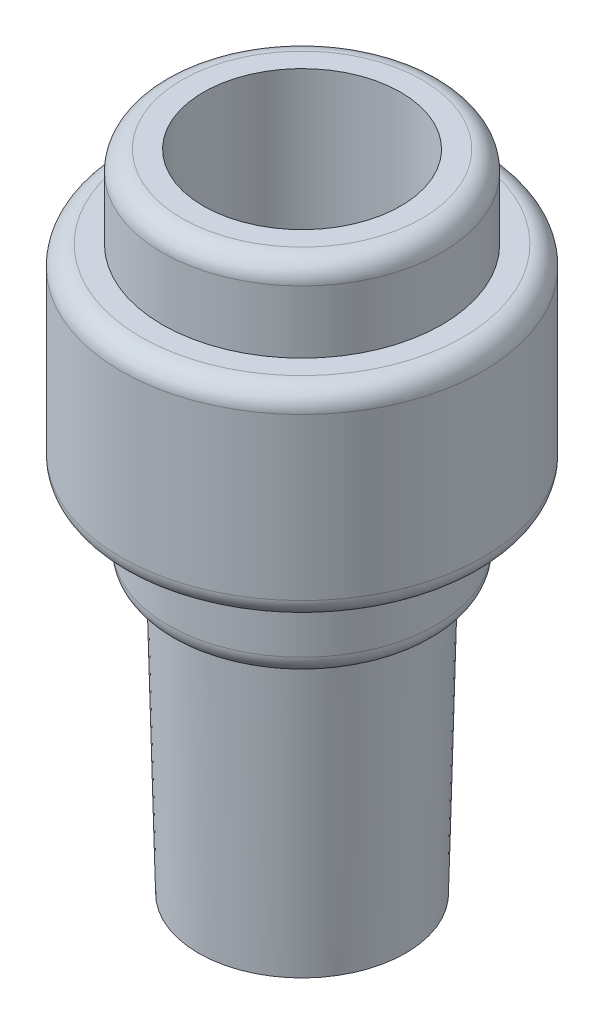
ISO-10303-21;
HEADER;
FILE_DESCRIPTION(('STEP AP214'),'2;1');
FILE_NAME('part.step','',(''),(''),'','','');
FILE_SCHEMA(('AUTOMOTIVE_DESIGN { 1 0 10303 214 1 1 1 1 }'));
ENDSEC;
DATA;
#1=APPLICATION_CONTEXT('core data for automotive mechanical design processes');
#2=APPLICATION_PROTOCOL_DEFINITION('international standard','automotive_design',2000,#1);
#3=PRODUCT_CONTEXT('',#1,'mechanical');
#4=PRODUCT('Part','Part','',(#3));
#5=PRODUCT_RELATED_PRODUCT_CATEGORY('part','',(#4));
#6=PRODUCT_DEFINITION_FORMATION('','',#4);
#7=PRODUCT_DEFINITION_CONTEXT('part definition',#1,'design');
#8=PRODUCT_DEFINITION('design','',#6,#7);
#9=PRODUCT_DEFINITION_SHAPE('','',#8);
#10=(LENGTH_UNIT() NAMED_UNIT(*) SI_UNIT(.MILLI.,.METRE.));
#11=(NAMED_UNIT(*) PLANE_ANGLE_UNIT() SI_UNIT($,.RADIAN.));
#12=(NAMED_UNIT(*) SI_UNIT($,.STERADIAN.) SOLID_ANGLE_UNIT());
#13=UNCERTAINTY_MEASURE_WITH_UNIT(LENGTH_MEASURE(1.E-05),#10,'distance_accuracy_value','');
#14=(GEOMETRIC_REPRESENTATION_CONTEXT(3) GLOBAL_UNCERTAINTY_ASSIGNED_CONTEXT((#13)) GLOBAL_UNIT_ASSIGNED_CONTEXT((#10,
#11,#12)) REPRESENTATION_CONTEXT('',''));
#15=CARTESIAN_POINT('',(0.,0.,0.));
#16=DIRECTION('',(0.,0.,1.));
#17=DIRECTION('',(1.,0.,0.));
#18=AXIS2_PLACEMENT_3D('',#15,#16,#17);
#19=CARTESIAN_POINT('',(0.,17.1,0.));
#20=DIRECTION('',(0.,1.,0.));
#21=DIRECTION('',(0.,0.,1.));
#22=AXIS2_PLACEMENT_3D('',#19,#20,#21);
#23=PLANE('',#22);
#24=CARTESIAN_POINT('',(0.,17.1,0.));
#25=DIRECTION('',(0.,1.,0.));
#26=DIRECTION('',(0.,0.,1.));
#27=AXIS2_PLACEMENT_3D('',#24,#25,#26);
#28=CIRCLE('',#27,4.9);
#29=CARTESIAN_POINT('',(0.,17.1,4.9));
#30=VERTEX_POINT('',#29);
#31=EDGE_CURVE('E42',#30,#30,#28,.T.);
#32=ORIENTED_EDGE('',*,*,#31,.T.);
#33=EDGE_LOOP('',(#32));
#34=FACE_BOUND('',#33,.T.);
#35=CARTESIAN_POINT('',(0.,17.1,0.));
#36=DIRECTION('',(0.,1.,0.));
#37=DIRECTION('',(0.,0.,1.));
#38=AXIS2_PLACEMENT_3D('',#35,#36,#37);
#39=CIRCLE('',#38,4.25);
#40=CARTESIAN_POINT('',(0.,17.1,4.25));
#41=VERTEX_POINT('',#40);
#42=EDGE_CURVE('E72',#41,#41,#39,.T.);
#43=ORIENTED_EDGE('',*,*,#42,.F.);
#44=EDGE_LOOP('',(#43));
#45=FACE_BOUND('',#44,.T.);
#46=ADVANCED_FACE('F31',(#34,#45),#23,.T.);
#47=CARTESIAN_POINT('',(0.,0.,0.));
#48=DIRECTION('',(0.,1.,0.));
#49=DIRECTION('',(0.,0.,1.));
#50=AXIS2_PLACEMENT_3D('',#47,#48,#49);
#51=CONICAL_SURFACE('',#50,3.15,0.0235619449019235);
#52=CARTESIAN_POINT('',(0.,8.5,0.));
#53=DIRECTION('',(0.,1.,0.));
#54=DIRECTION('',(0.,0.,1.));
#55=AXIS2_PLACEMENT_3D('',#52,#53,#54);
#56=CIRCLE('',#55,3.35031360208855);
#57=CARTESIAN_POINT('',(0.,8.5,3.35031360208855));
#58=VERTEX_POINT('',#57);
#59=EDGE_CURVE('E63',#58,#58,#56,.T.);
#60=ORIENTED_EDGE('',*,*,#59,.F.);
#61=EDGE_LOOP('',(#60));
#62=FACE_BOUND('',#61,.T.);
#63=CARTESIAN_POINT('',(0.,0.,0.));
#64=DIRECTION('',(0.,1.,0.));
#65=DIRECTION('',(0.,0.,1.));
#66=AXIS2_PLACEMENT_3D('',#63,#64,#65);
#67=CIRCLE('',#66,3.15);
#68=CARTESIAN_POINT('',(0.,0.,3.15));
#69=VERTEX_POINT('',#68);
#70=EDGE_CURVE('E66',#69,#69,#67,.T.);
#71=ORIENTED_EDGE('',*,*,#70,.T.);
#72=EDGE_LOOP('',(#71));
#73=FACE_BOUND('',#72,.T.);
#74=ADVANCED_FACE('F95',(#62,#73),#51,.T.);
#75=CARTESIAN_POINT('',(0.,0.,0.));
#76=DIRECTION('',(0.,1.,0.));
#77=DIRECTION('',(0.,0.,1.));
#78=AXIS2_PLACEMENT_3D('',#75,#76,#77);
#79=PLANE('',#78);
#80=CARTESIAN_POINT('',(0.,0.,0.));
#81=DIRECTION('',(0.,-1.,0.));
#82=DIRECTION('',(0.,0.,-1.));
#83=AXIS2_PLACEMENT_3D('',#80,#81,#82);
#84=CIRCLE('',#83,1.5);
#85=CARTESIAN_POINT('',(0.,0.,-1.5));
#86=VERTEX_POINT('',#85);
#87=EDGE_CURVE('E84',#86,#86,#84,.T.);
#88=ORIENTED_EDGE('',*,*,#87,.F.);
#89=EDGE_LOOP('',(#88));
#90=FACE_BOUND('',#89,.T.);
#91=ORIENTED_EDGE('',*,*,#70,.F.);
#92=EDGE_LOOP('',(#91));
#93=FACE_BOUND('',#92,.T.);
#94=ADVANCED_FACE('F91',(#90,#93),#79,.F.);
#95=CARTESIAN_POINT('',(0.,8.5,0.));
#96=DIRECTION('',(0.,1.,0.));
#97=DIRECTION('',(0.,0.,1.));
#98=AXIS2_PLACEMENT_3D('',#95,#96,#97);
#99=PLANE('',#98);
#100=CARTESIAN_POINT('',(0.,8.5,0.));
#101=DIRECTION('',(0.,1.,0.));
#102=DIRECTION('',(0.,0.,1.));
#103=AXIS2_PLACEMENT_3D('',#100,#101,#102);
#104=CIRCLE('',#103,3.475);
#105=CARTESIAN_POINT('',(0.,8.5,3.475));
#106=VERTEX_POINT('',#105);
#107=EDGE_CURVE('E57',#106,#106,#104,.F.);
#108=ORIENTED_EDGE('',*,*,#107,.T.);
#109=EDGE_LOOP('',(#108));
#110=FACE_BOUND('',#109,.T.);
#111=ORIENTED_EDGE('',*,*,#59,.T.);
#112=EDGE_LOOP('',(#111));
#113=FACE_BOUND('',#112,.T.);
#114=ADVANCED_FACE('F94',(#110,#113),#99,.F.);
#115=CARTESIAN_POINT('',(0.,11.,0.));
#116=DIRECTION('',(0.,-1.,0.));
#117=DIRECTION('',(0.,0.,-1.));
#118=AXIS2_PLACEMENT_3D('',#115,#116,#117);
#119=CYLINDRICAL_SURFACE('',#118,4.075);
#120=CARTESIAN_POINT('',(0.,9.1,0.));
#121=DIRECTION('',(0.,1.,0.));
#122=DIRECTION('',(0.,0.,1.));
#123=AXIS2_PLACEMENT_3D('',#120,#121,#122);
#124=CIRCLE('',#123,4.075);
#125=CARTESIAN_POINT('',(0.,9.1,4.075));
#126=VERTEX_POINT('',#125);
#127=EDGE_CURVE('E60',#126,#126,#124,.T.);
#128=ORIENTED_EDGE('',*,*,#127,.T.);
#129=EDGE_LOOP('',(#128));
#130=FACE_BOUND('',#129,.T.);
#131=CARTESIAN_POINT('',(0.,11.,0.));
#132=DIRECTION('',(0.,1.,0.));
#133=DIRECTION('',(0.,0.,1.));
#134=AXIS2_PLACEMENT_3D('',#131,#132,#133);
#135=CIRCLE('',#134,4.075);
#136=CARTESIAN_POINT('',(0.,11.,4.075));
#137=VERTEX_POINT('',#136);
#138=EDGE_CURVE('E69',#137,#137,#135,.T.);
#139=ORIENTED_EDGE('',*,*,#138,.F.);
#140=EDGE_LOOP('',(#139));
#141=FACE_BOUND('',#140,.T.);
#142=ADVANCED_FACE('F147',(#130,#141),#119,.T.);
#143=CARTESIAN_POINT('',(0.,11.,0.));
#144=DIRECTION('',(0.,1.,0.));
#145=DIRECTION('',(0.,0.,1.));
#146=AXIS2_PLACEMENT_3D('',#143,#144,#145);
#147=PLANE('',#146);
#148=CARTESIAN_POINT('',(0.,11.,0.));
#149=DIRECTION('',(0.,1.,0.));
#150=DIRECTION('',(0.,0.,1.));
#151=AXIS2_PLACEMENT_3D('',#148,#149,#150);
#152=CIRCLE('',#151,4.9);
#153=CARTESIAN_POINT('',(0.,11.,4.9));
#154=VERTEX_POINT('',#153);
#155=EDGE_CURVE('E46',#154,#154,#152,.F.);
#156=ORIENTED_EDGE('',*,*,#155,.T.);
#157=EDGE_LOOP('',(#156));
#158=FACE_BOUND('',#157,.T.);
#159=ORIENTED_EDGE('',*,*,#138,.T.);
#160=EDGE_LOOP('',(#159));
#161=FACE_BOUND('',#160,.T.);
#162=ADVANCED_FACE('F141',(#158,#161),#147,.F.);
#163=CARTESIAN_POINT('',(0.,17.1,0.));
#164=DIRECTION('',(0.,-1.,0.));
#165=DIRECTION('',(0.,0.,-1.));
#166=AXIS2_PLACEMENT_3D('',#163,#164,#165);
#167=CYLINDRICAL_SURFACE('',#166,5.5);
#168=CARTESIAN_POINT('',(0.,11.6,0.));
#169=DIRECTION('',(0.,1.,0.));
#170=DIRECTION('',(0.,0.,1.));
#171=AXIS2_PLACEMENT_3D('',#168,#169,#170);
#172=CIRCLE('',#171,5.5);
#173=CARTESIAN_POINT('',(0.,11.6,5.5));
#174=VERTEX_POINT('',#173);
#175=EDGE_CURVE('E51',#174,#174,#172,.T.);
#176=ORIENTED_EDGE('',*,*,#175,.T.);
#177=EDGE_LOOP('',(#176));
#178=FACE_BOUND('',#177,.T.);
#179=CARTESIAN_POINT('',(0.,16.5,0.));
#180=DIRECTION('',(0.,1.,0.));
#181=DIRECTION('',(0.,0.,1.));
#182=AXIS2_PLACEMENT_3D('',#179,#180,#181);
#183=CIRCLE('',#182,5.5);
#184=CARTESIAN_POINT('',(0.,16.5,5.5));
#185=VERTEX_POINT('',#184);
#186=EDGE_CURVE('E54',#185,#185,#183,.F.);
#187=ORIENTED_EDGE('',*,*,#186,.T.);
#188=EDGE_LOOP('',(#187));
#189=FACE_BOUND('',#188,.T.);
#190=ADVANCED_FACE('F133',(#178,#189),#167,.T.);
#191=CARTESIAN_POINT('',(0.,19.6,0.));
#192=DIRECTION('',(0.,-1.,0.));
#193=DIRECTION('',(0.,0.,-1.));
#194=AXIS2_PLACEMENT_3D('',#191,#192,#193);
#195=CYLINDRICAL_SURFACE('',#194,4.25);
#196=CARTESIAN_POINT('',(0.,19.,0.));
#197=DIRECTION('',(0.,1.,0.));
#198=DIRECTION('',(0.,0.,1.));
#199=AXIS2_PLACEMENT_3D('',#196,#197,#198);
#200=CIRCLE('',#199,4.25);
#201=CARTESIAN_POINT('',(0.,19.,4.25));
#202=VERTEX_POINT('',#201);
#203=EDGE_CURVE('E10',#202,#202,#200,.F.);
#204=ORIENTED_EDGE('',*,*,#203,.T.);
#205=EDGE_LOOP('',(#204));
#206=FACE_BOUND('',#205,.T.);
#207=ORIENTED_EDGE('',*,*,#42,.T.);
#208=EDGE_LOOP('',(#207));
#209=FACE_BOUND('',#208,.T.);
#210=ADVANCED_FACE('F130',(#206,#209),#195,.T.);
#211=CARTESIAN_POINT('',(0.,19.6,0.));
#212=DIRECTION('',(0.,1.,0.));
#213=DIRECTION('',(0.,0.,1.));
#214=AXIS2_PLACEMENT_3D('',#211,#212,#213);
#215=PLANE('',#214);
#216=CARTESIAN_POINT('',(0.,19.6,0.));
#217=DIRECTION('',(0.,1.,0.));
#218=DIRECTION('',(0.,0.,1.));
#219=AXIS2_PLACEMENT_3D('',#216,#217,#218);
#220=CIRCLE('',#219,3.65);
#221=CARTESIAN_POINT('',(0.,19.6,3.65));
#222=VERTEX_POINT('',#221);
#223=EDGE_CURVE('E38',#222,#222,#220,.T.);
#224=ORIENTED_EDGE('',*,*,#223,.T.);
#225=EDGE_LOOP('',(#224));
#226=FACE_BOUND('',#225,.T.);
#227=CARTESIAN_POINT('',(0.,19.6,0.));
#228=DIRECTION('',(0.,1.,0.));
#229=DIRECTION('',(0.,0.,1.));
#230=AXIS2_PLACEMENT_3D('',#227,#228,#229);
#231=CIRCLE('',#230,3.);
#232=CARTESIAN_POINT('',(0.,19.6,3.));
#233=VERTEX_POINT('',#232);
#234=EDGE_CURVE('E76',#233,#233,#231,.T.);
#235=ORIENTED_EDGE('',*,*,#234,.F.);
#236=EDGE_LOOP('',(#235));
#237=FACE_BOUND('',#236,.T.);
#238=ADVANCED_FACE('F132',(#226,#237),#215,.T.);
#239=CARTESIAN_POINT('',(0.,13.1,0.));
#240=DIRECTION('',(0.,1.,0.));
#241=DIRECTION('',(0.,0.,1.));
#242=AXIS2_PLACEMENT_3D('',#239,#240,#241);
#243=CYLINDRICAL_SURFACE('',#242,3.);
#244=CARTESIAN_POINT('',(0.,13.1,0.));
#245=DIRECTION('',(0.,1.,0.));
#246=DIRECTION('',(0.,0.,1.));
#247=AXIS2_PLACEMENT_3D('',#244,#245,#246);
#248=CIRCLE('',#247,3.);
#249=CARTESIAN_POINT('',(0.,13.1,3.));
#250=VERTEX_POINT('',#249);
#251=EDGE_CURVE('E75',#250,#250,#248,.T.);
#252=ORIENTED_EDGE('',*,*,#251,.F.);
#253=EDGE_LOOP('',(#252));
#254=FACE_BOUND('',#253,.T.);
#255=ORIENTED_EDGE('',*,*,#234,.T.);
#256=EDGE_LOOP('',(#255));
#257=FACE_BOUND('',#256,.T.);
#258=ADVANCED_FACE('F139',(#254,#257),#243,.F.);
#259=CARTESIAN_POINT('',(0.,13.1,0.));
#260=DIRECTION('',(0.,1.,0.));
#261=DIRECTION('',(0.,0.,1.));
#262=AXIS2_PLACEMENT_3D('',#259,#260,#261);
#263=PLANE('',#262);
#264=CARTESIAN_POINT('',(0.,13.1,0.));
#265=DIRECTION('',(0.,1.,0.));
#266=DIRECTION('',(0.,0.,1.));
#267=AXIS2_PLACEMENT_3D('',#264,#265,#266);
#268=CIRCLE('',#267,1.5);
#269=CARTESIAN_POINT('',(0.,13.1,1.5));
#270=VERTEX_POINT('',#269);
#271=EDGE_CURVE('E79',#270,#270,#268,.F.);
#272=ORIENTED_EDGE('',*,*,#271,.T.);
#273=EDGE_LOOP('',(#272));
#274=FACE_BOUND('',#273,.T.);
#275=ORIENTED_EDGE('',*,*,#251,.T.);
#276=EDGE_LOOP('',(#275));
#277=FACE_BOUND('',#276,.T.);
#278=ADVANCED_FACE('F215',(#274,#277),#263,.T.);
#279=CARTESIAN_POINT('',(0.,17.3426406871193,0.));
#280=DIRECTION('',(0.,-1.,0.));
#281=DIRECTION('',(0.,0.,-1.));
#282=AXIS2_PLACEMENT_3D('',#279,#280,#281);
#283=CYLINDRICAL_SURFACE('',#282,1.5);
#284=ORIENTED_EDGE('',*,*,#87,.T.);
#285=EDGE_LOOP('',(#284));
#286=FACE_BOUND('',#285,.T.);
#287=ORIENTED_EDGE('',*,*,#271,.F.);
#288=EDGE_LOOP('',(#287));
#289=FACE_BOUND('',#288,.T.);
#290=ADVANCED_FACE('F88',(#286,#289),#283,.F.);
#291=CARTESIAN_POINT('',(0.,9.1,0.));
#292=DIRECTION('',(0.,1.,0.));
#293=DIRECTION('',(0.,0.,1.));
#294=AXIS2_PLACEMENT_3D('',#291,#292,#293);
#295=TOROIDAL_SURFACE('',#294,3.475,0.6);
#296=ORIENTED_EDGE('',*,*,#107,.F.);
#297=EDGE_LOOP('',(#296));
#298=FACE_BOUND('',#297,.T.);
#299=ORIENTED_EDGE('',*,*,#127,.F.);
#300=EDGE_LOOP('',(#299));
#301=FACE_BOUND('',#300,.T.);
#302=ADVANCED_FACE('F110',(#298,#301),#295,.T.);
#303=CARTESIAN_POINT('',(0.,11.6,0.));
#304=DIRECTION('',(0.,1.,0.));
#305=DIRECTION('',(0.,0.,1.));
#306=AXIS2_PLACEMENT_3D('',#303,#304,#305);
#307=TOROIDAL_SURFACE('',#306,4.9,0.6);
#308=ORIENTED_EDGE('',*,*,#155,.F.);
#309=EDGE_LOOP('',(#308));
#310=FACE_BOUND('',#309,.T.);
#311=ORIENTED_EDGE('',*,*,#175,.F.);
#312=EDGE_LOOP('',(#311));
#313=FACE_BOUND('',#312,.T.);
#314=ADVANCED_FACE('F113',(#310,#313),#307,.T.);
#315=CARTESIAN_POINT('',(0.,16.5,0.));
#316=DIRECTION('',(0.,1.,0.));
#317=DIRECTION('',(0.,0.,1.));
#318=AXIS2_PLACEMENT_3D('',#315,#316,#317);
#319=TOROIDAL_SURFACE('',#318,4.9,0.6);
#320=ORIENTED_EDGE('',*,*,#186,.F.);
#321=EDGE_LOOP('',(#320));
#322=FACE_BOUND('',#321,.T.);
#323=ORIENTED_EDGE('',*,*,#31,.F.);
#324=EDGE_LOOP('',(#323));
#325=FACE_BOUND('',#324,.T.);
#326=ADVANCED_FACE('F116',(#322,#325),#319,.T.);
#327=CARTESIAN_POINT('',(0.,19.,0.));
#328=DIRECTION('',(0.,1.,0.));
#329=DIRECTION('',(0.,0.,1.));
#330=AXIS2_PLACEMENT_3D('',#327,#328,#329);
#331=TOROIDAL_SURFACE('',#330,3.65,0.6);
#332=ORIENTED_EDGE('',*,*,#203,.F.);
#333=EDGE_LOOP('',(#332));
#334=FACE_BOUND('',#333,.T.);
#335=ORIENTED_EDGE('',*,*,#223,.F.);
#336=EDGE_LOOP('',(#335));
#337=FACE_BOUND('',#336,.T.);
#338=ADVANCED_FACE('F33',(#334,#337),#331,.T.);
#339=CLOSED_SHELL('',(#46,#74,#94,#114,#142,#162,#190,#210,#238,#258,#278,#290,#302,#314,#326,#338));
#340=MANIFOLD_SOLID_BREP('B2',#339);
#341=ADVANCED_BREP_SHAPE_REPRESENTATION('',(#18,#340),#14);
#342=SHAPE_DEFINITION_REPRESENTATION(#9,#341);
ENDSEC;
END-ISO-10303-21;
